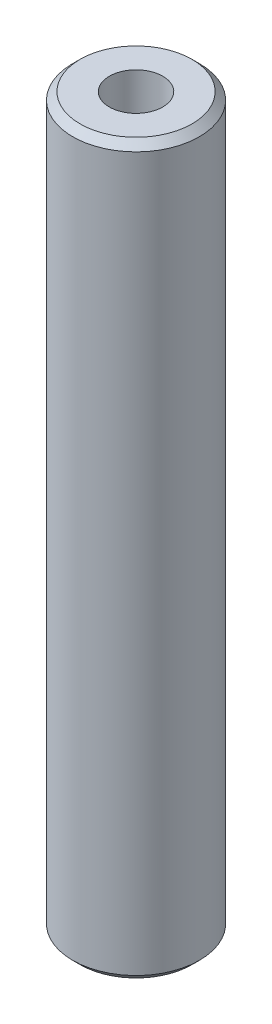
ISO-10303-21;
HEADER;
FILE_DESCRIPTION(('STEP AP214'),'2;1');
FILE_NAME('part.step','',(''),(''),'','','');
FILE_SCHEMA(('AUTOMOTIVE_DESIGN { 1 0 10303 214 1 1 1 1 }'));
ENDSEC;
DATA;
#1=APPLICATION_CONTEXT('core data for automotive mechanical design processes');
#2=APPLICATION_PROTOCOL_DEFINITION('international standard','automotive_design',2000,#1);
#3=PRODUCT_CONTEXT('',#1,'mechanical');
#4=PRODUCT('Part','Part','',(#3));
#5=PRODUCT_RELATED_PRODUCT_CATEGORY('part','',(#4));
#6=PRODUCT_DEFINITION_FORMATION('','',#4);
#7=PRODUCT_DEFINITION_CONTEXT('part definition',#1,'design');
#8=PRODUCT_DEFINITION('design','',#6,#7);
#9=PRODUCT_DEFINITION_SHAPE('','',#8);
#10=(LENGTH_UNIT() NAMED_UNIT(*) SI_UNIT(.MILLI.,.METRE.));
#11=(NAMED_UNIT(*) PLANE_ANGLE_UNIT() SI_UNIT($,.RADIAN.));
#12=(NAMED_UNIT(*) SI_UNIT($,.STERADIAN.) SOLID_ANGLE_UNIT());
#13=UNCERTAINTY_MEASURE_WITH_UNIT(LENGTH_MEASURE(1.E-05),#10,'distance_accuracy_value','');
#14=(GEOMETRIC_REPRESENTATION_CONTEXT(3) GLOBAL_UNCERTAINTY_ASSIGNED_CONTEXT((#13)) GLOBAL_UNIT_ASSIGNED_CONTEXT((#10,
#11,#12)) REPRESENTATION_CONTEXT('',''));
#15=CARTESIAN_POINT('',(0.,0.,0.));
#16=DIRECTION('',(0.,0.,1.));
#17=DIRECTION('',(1.,0.,0.));
#18=AXIS2_PLACEMENT_3D('',#15,#16,#17);
#19=CARTESIAN_POINT('',(0.,57.452031265802,0.));
#20=DIRECTION('',(0.,-1.,0.));
#21=DIRECTION('',(0.,0.,-1.));
#22=AXIS2_PLACEMENT_3D('',#19,#20,#21);
#23=CYLINDRICAL_SURFACE('',#22,5.);
#24=CARTESIAN_POINT('',(0.,56.8669710434452,0.));
#25=DIRECTION('',(0.,1.,0.));
#26=DIRECTION('',(0.,0.,1.));
#27=AXIS2_PLACEMENT_3D('',#24,#25,#26);
#28=CIRCLE('',#27,5.);
#29=CARTESIAN_POINT('',(0.,56.8669710434452,-5.));
#30=VERTEX_POINT('',#29);
#31=EDGE_CURVE('E50',#30,#30,#28,.F.);
#32=CARTESIAN_POINT('',(0.,0.585060222356951,0.));
#33=DIRECTION('',(0.,1.,0.));
#34=DIRECTION('',(0.,0.,1.));
#35=AXIS2_PLACEMENT_3D('',#32,#33,#34);
#36=CIRCLE('',#35,5.);
#37=CARTESIAN_POINT('',(0.,0.585060222356944,-5.));
#38=VERTEX_POINT('',#37);
#39=EDGE_CURVE('E51',#38,#38,#36,.T.);
#40=CARTESIAN_POINT('',(0.,56.8669710434452,-5.));
#41=CARTESIAN_POINT('',(0.,56.2807011390588,-5.));
#42=CARTESIAN_POINT('',(0.,55.6944312346725,-5.));
#43=CARTESIAN_POINT('',(0.,54.5218914258998,-5.));
#44=CARTESIAN_POINT('',(0.,53.9356215215135,-5.));
#45=CARTESIAN_POINT('',(0.,52.7630817127408,-5.));
#46=CARTESIAN_POINT('',(0.,52.1768118083545,-5.));
#47=CARTESIAN_POINT('',(0.,51.0042719995818,-5.));
#48=CARTESIAN_POINT('',(0.,50.4180020951955,-5.));
#49=CARTESIAN_POINT('',(0.,49.2454622864228,-5.));
#50=CARTESIAN_POINT('',(0.,48.6591923820365,-5.));
#51=CARTESIAN_POINT('',(0.,47.4866525732638,-5.));
#52=CARTESIAN_POINT('',(0.,46.9003826688775,-5.));
#53=CARTESIAN_POINT('',(0.,45.7278428601048,-5.));
#54=CARTESIAN_POINT('',(0.,45.1415729557185,-5.));
#55=CARTESIAN_POINT('',(0.,43.9690331469458,-5.));
#56=CARTESIAN_POINT('',(0.,43.3827632425595,-5.));
#57=CARTESIAN_POINT('',(0.,42.2102234337868,-5.));
#58=CARTESIAN_POINT('',(0.,41.6239535294005,-5.));
#59=CARTESIAN_POINT('',(0.,40.4514137206278,-5.));
#60=CARTESIAN_POINT('',(0.,39.8651438162414,-5.));
#61=CARTESIAN_POINT('',(0.,38.6926040074688,-5.));
#62=CARTESIAN_POINT('',(0.,38.1063341030824,-5.));
#63=CARTESIAN_POINT('',(0.,36.9337942943098,-5.));
#64=CARTESIAN_POINT('',(0.,36.3475243899234,-5.));
#65=CARTESIAN_POINT('',(0.,35.1749845811508,-5.));
#66=CARTESIAN_POINT('',(0.,34.5887146767644,-5.));
#67=CARTESIAN_POINT('',(0.,33.4161748679917,-5.));
#68=CARTESIAN_POINT('',(0.,32.8299049636054,-5.));
#69=CARTESIAN_POINT('',(0.,31.6573651548327,-5.));
#70=CARTESIAN_POINT('',(0.,31.0710952504464,-5.));
#71=CARTESIAN_POINT('',(0.,29.8985554416737,-5.));
#72=CARTESIAN_POINT('',(0.,29.3122855372874,-5.));
#73=CARTESIAN_POINT('',(0.,28.1397457285147,-5.));
#74=CARTESIAN_POINT('',(0.,27.5534758241284,-5.));
#75=CARTESIAN_POINT('',(0.,26.3809360153557,-5.));
#76=CARTESIAN_POINT('',(0.,25.7946661109694,-5.));
#77=CARTESIAN_POINT('',(0.,24.6221263021967,-5.));
#78=CARTESIAN_POINT('',(0.,24.0358563978104,-5.));
#79=CARTESIAN_POINT('',(0.,22.8633165890377,-5.));
#80=CARTESIAN_POINT('',(0.,22.2770466846514,-5.));
#81=CARTESIAN_POINT('',(0.,21.1045068758787,-5.));
#82=CARTESIAN_POINT('',(0.,20.5182369714924,-5.));
#83=CARTESIAN_POINT('',(0.,19.3456971627197,-5.));
#84=CARTESIAN_POINT('',(0.,18.7594272583334,-5.));
#85=CARTESIAN_POINT('',(0.,17.5868874495607,-5.));
#86=CARTESIAN_POINT('',(0.,17.0006175451744,-5.));
#87=CARTESIAN_POINT('',(0.,15.8280777364017,-5.));
#88=CARTESIAN_POINT('',(0.,15.2418078320153,-5.));
#89=CARTESIAN_POINT('',(0.,14.0692680232427,-5.));
#90=CARTESIAN_POINT('',(0.,13.4829981188563,-5.));
#91=CARTESIAN_POINT('',(0.,12.3104583100837,-5.));
#92=CARTESIAN_POINT('',(0.,11.7241884056973,-5.));
#93=CARTESIAN_POINT('',(0.,10.5516485969247,-5.));
#94=CARTESIAN_POINT('',(0.,9.96537869253832,-5.));
#95=CARTESIAN_POINT('',(0.,8.79283888376564,-5.));
#96=CARTESIAN_POINT('',(0.,8.20656897937931,-5.));
#97=CARTESIAN_POINT('',(0.,7.03402917060664,-5.));
#98=CARTESIAN_POINT('',(0.,6.4477592662203,-5.));
#99=CARTESIAN_POINT('',(0.,5.27521945744764,-5.));
#100=CARTESIAN_POINT('',(0.,4.6889495530613,-5.));
#101=CARTESIAN_POINT('',(0.,3.51640974428863,-5.));
#102=CARTESIAN_POINT('',(0.,2.93013983990229,-5.));
#103=CARTESIAN_POINT('',(0.,1.75760003112961,-5.));
#104=CARTESIAN_POINT('',(0.,1.17133012674328,-5.));
#105=CARTESIAN_POINT('',(0.,0.585060222356944,-5.));
#106=B_SPLINE_CURVE_WITH_KNOTS('',3,(#40,#41,#42,#43,#44,#45,#46,#47,#48,#49,#50,#51,#52,#53,
#54,#55,#56,#57,#58,#59,#60,#61,#62,#63,#64,#65,#66,#67,#68,#69,#70,#71,#72,#73,#74,#75,#76,#77,
#78,#79,#80,#81,#82,#83,#84,#85,#86,#87,#88,#89,#90,#91,#92,#93,#94,#95,#96,#97,#98,#99,#100,
#101,#102,#103,#104,#105),.UNSPECIFIED.,.F.,.F.,(4,2,2,2,2,2,2,2,2,2,2,2,2,2,2,2,2,2,2,2,2,2,2,
2,2,2,2,2,2,2,2,2,4),(0.,1.75880971315901,3.51761942631802,5.27642913947703,7.03523885263603,
8.79404856579504,10.552858278954,12.3116679921131,14.0704777052721,15.8292874184311,
17.5880971315901,19.3469068447491,21.1057165579081,22.8645262710671,24.6233359842261,
26.3821456973851,28.1409554105441,29.8997651237031,31.6585748368621,33.4173845500211,
35.1761942631802,36.9350039763392,38.6938136894982,40.4526234026572,42.2114331158162,
43.9702428289752,45.7290525421342,47.4878622552932,49.2466719684522,51.0054816816112,
52.7642913947702,54.5231011079292,56.2819108210882),.UNSPECIFIED.);
#107=EDGE_CURVE('BSEAM39',#30,#38,#106,.T.);
#108=ORIENTED_EDGE('',*,*,#31,.T.);
#109=ORIENTED_EDGE('',*,*,#39,.T.);
#110=ORIENTED_EDGE('',*,*,#107,.T.);
#111=ORIENTED_EDGE('',*,*,#107,.F.);
#112=EDGE_LOOP('',(#108,#110,#109,#111));
#113=FACE_BOUND('',#112,.T.);
#114=ADVANCED_FACE('F39',(#113),#23,.T.);
#115=CARTESIAN_POINT('',(0.,57.452031265802,0.));
#116=DIRECTION('',(0.,1.,0.));
#117=DIRECTION('',(0.,0.,1.));
#118=AXIS2_PLACEMENT_3D('',#115,#116,#117);
#119=PLANE('',#118);
#120=CARTESIAN_POINT('',(0.,57.452031265802,0.));
#121=DIRECTION('',(0.,1.,0.));
#122=DIRECTION('',(0.,0.,1.));
#123=AXIS2_PLACEMENT_3D('',#120,#121,#122);
#124=CIRCLE('',#123,4.41493977764314);
#125=CARTESIAN_POINT('',(0.,57.452031265802,4.41493977764314));
#126=VERTEX_POINT('',#125);
#127=EDGE_CURVE('E54',#126,#126,#124,.T.);
#128=ORIENTED_EDGE('',*,*,#127,.T.);
#129=EDGE_LOOP('',(#128));
#130=FACE_BOUND('',#129,.T.);
#131=CARTESIAN_POINT('',(0.,57.452031265802,0.));
#132=DIRECTION('',(0.,1.,0.));
#133=DIRECTION('',(0.,0.,1.));
#134=AXIS2_PLACEMENT_3D('',#131,#132,#133);
#135=CIRCLE('',#134,2.1068981169838);
#136=CARTESIAN_POINT('',(0.,57.452031265802,-2.1068981169838));
#137=VERTEX_POINT('',#136);
#138=EDGE_CURVE('E58',#137,#137,#135,.T.);
#139=ORIENTED_EDGE('',*,*,#138,.F.);
#140=EDGE_LOOP('',(#139));
#141=FACE_BOUND('',#140,.T.);
#142=ADVANCED_FACE('F69',(#130,#141),#119,.T.);
#143=CARTESIAN_POINT('',(0.,0.,0.));
#144=DIRECTION('',(0.,1.,0.));
#145=DIRECTION('',(0.,0.,1.));
#146=AXIS2_PLACEMENT_3D('',#143,#144,#145);
#147=PLANE('',#146);
#148=CARTESIAN_POINT('',(0.,0.,0.));
#149=DIRECTION('',(0.,1.,0.));
#150=DIRECTION('',(0.,0.,1.));
#151=AXIS2_PLACEMENT_3D('',#148,#149,#150);
#152=CIRCLE('',#151,4.41493977764304);
#153=CARTESIAN_POINT('',(0.,0.,4.41493977764304));
#154=VERTEX_POINT('',#153);
#155=EDGE_CURVE('E10',#154,#154,#152,.F.);
#156=ORIENTED_EDGE('',*,*,#155,.T.);
#157=EDGE_LOOP('',(#156));
#158=FACE_BOUND('',#157,.T.);
#159=CARTESIAN_POINT('',(0.,0.,0.));
#160=DIRECTION('',(0.,1.,0.));
#161=DIRECTION('',(0.,0.,1.));
#162=AXIS2_PLACEMENT_3D('',#159,#160,#161);
#163=CIRCLE('',#162,2.1068981169838);
#164=CARTESIAN_POINT('',(0.,0.,-2.1068981169838));
#165=VERTEX_POINT('',#164);
#166=EDGE_CURVE('E63',#165,#165,#163,.T.);
#167=ORIENTED_EDGE('',*,*,#166,.T.);
#168=EDGE_LOOP('',(#167));
#169=FACE_BOUND('',#168,.T.);
#170=ADVANCED_FACE('F75',(#158,#169),#147,.F.);
#171=CARTESIAN_POINT('',(0.,57.452031265802,0.));
#172=DIRECTION('',(0.,-1.,0.));
#173=DIRECTION('',(0.,0.,-1.));
#174=AXIS2_PLACEMENT_3D('',#171,#172,#173);
#175=CYLINDRICAL_SURFACE('',#174,2.1068981169838);
#176=CARTESIAN_POINT('',(0.,57.452031265802,-2.1068981169838));
#177=CARTESIAN_POINT('',(0.,56.8535726067833,-2.1068981169838));
#178=CARTESIAN_POINT('',(0.,56.2551139477645,-2.1068981169838));
#179=CARTESIAN_POINT('',(0.,55.058196629727,-2.1068981169838));
#180=CARTESIAN_POINT('',(0.,54.4597379707082,-2.1068981169838));
#181=CARTESIAN_POINT('',(0.,53.2628206526706,-2.1068981169838));
#182=CARTESIAN_POINT('',(0.,52.6643619936519,-2.1068981169838));
#183=CARTESIAN_POINT('',(0.,51.4674446756143,-2.1068981169838));
#184=CARTESIAN_POINT('',(0.,50.8689860165956,-2.1068981169838));
#185=CARTESIAN_POINT('',(0.,49.672068698558,-2.1068981169838));
#186=CARTESIAN_POINT('',(0.,49.0736100395392,-2.1068981169838));
#187=CARTESIAN_POINT('',(0.,47.8766927215017,-2.1068981169838));
#188=CARTESIAN_POINT('',(0.,47.2782340624829,-2.1068981169838));
#189=CARTESIAN_POINT('',(0.,46.0813167444454,-2.1068981169838));
#190=CARTESIAN_POINT('',(0.,45.4828580854266,-2.1068981169838));
#191=CARTESIAN_POINT('',(0.,44.2859407673891,-2.1068981169838));
#192=CARTESIAN_POINT('',(0.,43.6874821083703,-2.1068981169838));
#193=CARTESIAN_POINT('',(0.,42.4905647903328,-2.1068981169838));
#194=CARTESIAN_POINT('',(0.,41.892106131314,-2.1068981169838));
#195=CARTESIAN_POINT('',(0.,40.6951888132764,-2.1068981169838));
#196=CARTESIAN_POINT('',(0.,40.0967301542577,-2.1068981169838));
#197=CARTESIAN_POINT('',(0.,38.8998128362201,-2.1068981169838));
#198=CARTESIAN_POINT('',(0.,38.3013541772014,-2.1068981169838));
#199=CARTESIAN_POINT('',(0.,37.1044368591638,-2.1068981169838));
#200=CARTESIAN_POINT('',(0.,36.505978200145,-2.1068981169838));
#201=CARTESIAN_POINT('',(0.,35.3090608821075,-2.1068981169838));
#202=CARTESIAN_POINT('',(0.,34.7106022230887,-2.1068981169838));
#203=CARTESIAN_POINT('',(0.,33.5136849050512,-2.1068981169838));
#204=CARTESIAN_POINT('',(0.,32.9152262460324,-2.1068981169838));
#205=CARTESIAN_POINT('',(0.,31.7183089279949,-2.1068981169838));
#206=CARTESIAN_POINT('',(0.,31.1198502689761,-2.1068981169838));
#207=CARTESIAN_POINT('',(0.,29.9229329509386,-2.1068981169838));
#208=CARTESIAN_POINT('',(0.,29.3244742919198,-2.1068981169838));
#209=CARTESIAN_POINT('',(0.,28.1275569738822,-2.1068981169838));
#210=CARTESIAN_POINT('',(0.,27.5290983148635,-2.1068981169838));
#211=CARTESIAN_POINT('',(0.,26.3321809968259,-2.1068981169838));
#212=CARTESIAN_POINT('',(0.,25.7337223378072,-2.1068981169838));
#213=CARTESIAN_POINT('',(0.,24.5368050197696,-2.1068981169838));
#214=CARTESIAN_POINT('',(0.,23.9383463607509,-2.1068981169838));
#215=CARTESIAN_POINT('',(0.,22.7414290427133,-2.1068981169838));
#216=CARTESIAN_POINT('',(0.,22.1429703836945,-2.1068981169838));
#217=CARTESIAN_POINT('',(0.,20.946053065657,-2.1068981169838));
#218=CARTESIAN_POINT('',(0.,20.3475944066382,-2.1068981169838));
#219=CARTESIAN_POINT('',(0.,19.1506770886007,-2.1068981169838));
#220=CARTESIAN_POINT('',(0.,18.5522184295819,-2.1068981169838));
#221=CARTESIAN_POINT('',(0.,17.3553011115444,-2.1068981169838));
#222=CARTESIAN_POINT('',(0.,16.7568424525256,-2.1068981169838));
#223=CARTESIAN_POINT('',(0.,15.559925134488,-2.1068981169838));
#224=CARTESIAN_POINT('',(0.,14.9614664754693,-2.1068981169838));
#225=CARTESIAN_POINT('',(0.,13.7645491574317,-2.1068981169838));
#226=CARTESIAN_POINT('',(0.,13.166090498413,-2.1068981169838));
#227=CARTESIAN_POINT('',(0.,11.9691731803754,-2.1068981169838));
#228=CARTESIAN_POINT('',(0.,11.3707145213567,-2.1068981169838));
#229=CARTESIAN_POINT('',(0.,10.1737972033191,-2.1068981169838));
#230=CARTESIAN_POINT('',(0.,9.57533854430034,-2.1068981169838));
#231=CARTESIAN_POINT('',(0.,8.37842122626279,-2.1068981169838));
#232=CARTESIAN_POINT('',(0.,7.77996256724402,-2.1068981169838));
#233=CARTESIAN_POINT('',(0.,6.58304524920648,-2.1068981169838));
#234=CARTESIAN_POINT('',(0.,5.98458659018771,-2.1068981169838));
#235=CARTESIAN_POINT('',(0.,4.78766927215016,-2.1068981169838));
#236=CARTESIAN_POINT('',(0.,4.18921061313139,-2.1068981169838));
#237=CARTESIAN_POINT('',(0.,2.99229329509385,-2.1068981169838));
#238=CARTESIAN_POINT('',(0.,2.39383463607508,-2.1068981169838));
#239=CARTESIAN_POINT('',(0.,1.19691731803754,-2.1068981169838));
#240=CARTESIAN_POINT('',(0.,0.598458659018765,-2.1068981169838));
#241=CARTESIAN_POINT('',(0.,0.,-2.1068981169838));
#242=B_SPLINE_CURVE_WITH_KNOTS('',3,(#176,#177,#178,#179,#180,#181,#182,#183,#184,#185,#186,
#187,#188,#189,#190,#191,#192,#193,#194,#195,#196,#197,#198,#199,#200,#201,#202,#203,#204,#205,
#206,#207,#208,#209,#210,#211,#212,#213,#214,#215,#216,#217,#218,#219,#220,#221,#222,#223,#224,
#225,#226,#227,#228,#229,#230,#231,#232,#233,#234,#235,#236,#237,#238,#239,#240,#241),
.UNSPECIFIED.,.F.,.F.,(4,2,2,2,2,2,2,2,2,2,2,2,2,2,2,2,2,2,2,2,2,2,2,2,2,2,2,2,2,2,2,2,4),(0.,
1.79537597705632,3.59075195411263,5.38612793116894,7.18150390822526,8.97687988528158,
10.7722558623379,12.5676318393942,14.3630078164505,16.1583837935068,17.9537597705631,
19.7491357476195,21.5445117246758,23.3398877017321,25.1352636787884,26.9306396558447,
28.726015632901,30.5213916099573,32.3167675870137,34.11214356407,35.9075195411263,
37.7028955181826,39.4982714952389,41.2936474722952,43.0890234493515,44.8843994264079,
46.6797754034642,48.4751513805205,50.2705273575768,52.0659033346331,53.8612793116894,
55.6566552887457,57.4520312658021),.UNSPECIFIED.);
#243=EDGE_CURVE('BSEAM70',#137,#165,#242,.T.);
#244=ORIENTED_EDGE('',*,*,#138,.T.);
#245=ORIENTED_EDGE('',*,*,#166,.F.);
#246=ORIENTED_EDGE('',*,*,#243,.T.);
#247=ORIENTED_EDGE('',*,*,#243,.F.);
#248=EDGE_LOOP('',(#244,#246,#245,#247));
#249=FACE_BOUND('',#248,.T.);
#250=ADVANCED_FACE('F70',(#249),#175,.F.);
#251=CARTESIAN_POINT('',(0.,57.452031265802,0.));
#252=DIRECTION('',(0.,-1.,0.));
#253=DIRECTION('',(0.,0.,-1.));
#254=AXIS2_PLACEMENT_3D('',#251,#252,#253);
#255=CONICAL_SURFACE('',#254,4.41493977764314,0.785398163397445);
#256=ORIENTED_EDGE('',*,*,#31,.F.);
#257=EDGE_LOOP('',(#256));
#258=FACE_BOUND('',#257,.T.);
#259=ORIENTED_EDGE('',*,*,#127,.F.);
#260=EDGE_LOOP('',(#259));
#261=FACE_BOUND('',#260,.T.);
#262=ADVANCED_FACE('F81',(#258,#261),#255,.T.);
#263=CARTESIAN_POINT('',(0.,0.585060222356951,0.));
#264=DIRECTION('',(0.,1.,0.));
#265=DIRECTION('',(0.,0.,1.));
#266=AXIS2_PLACEMENT_3D('',#263,#264,#265);
#267=CONICAL_SURFACE('',#266,5.,0.785398163397457);
#268=ORIENTED_EDGE('',*,*,#155,.F.);
#269=EDGE_LOOP('',(#268));
#270=FACE_BOUND('',#269,.T.);
#271=ORIENTED_EDGE('',*,*,#39,.F.);
#272=EDGE_LOOP('',(#271));
#273=FACE_BOUND('',#272,.T.);
#274=ADVANCED_FACE('F45',(#270,#273),#267,.T.);
#275=CLOSED_SHELL('',(#114,#142,#170,#250,#262,#274));
#276=MANIFOLD_SOLID_BREP('B2',#275);
#277=ADVANCED_BREP_SHAPE_REPRESENTATION('',(#18,#276),#14);
#278=SHAPE_DEFINITION_REPRESENTATION(#9,#277);
ENDSEC;
END-ISO-10303-21;
